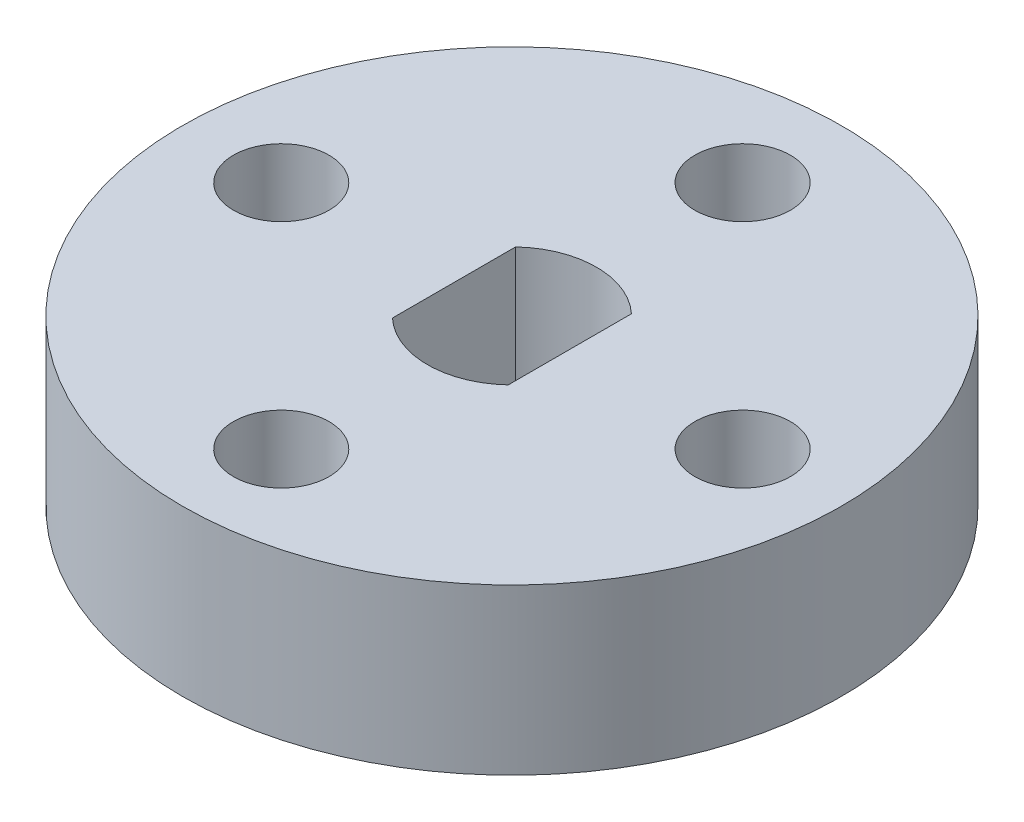
ISO-10303-21;
HEADER;
FILE_DESCRIPTION(('STEP AP214'),'2;1');
FILE_NAME('part.step','',(''),(''),'','','');
FILE_SCHEMA(('AUTOMOTIVE_DESIGN { 1 0 10303 214 1 1 1 1 }'));
ENDSEC;
DATA;
#1=APPLICATION_CONTEXT('core data for automotive mechanical design processes');
#2=APPLICATION_PROTOCOL_DEFINITION('international standard','automotive_design',2000,#1);
#3=PRODUCT_CONTEXT('',#1,'mechanical');
#4=PRODUCT('Part','Part','',(#3));
#5=PRODUCT_RELATED_PRODUCT_CATEGORY('part','',(#4));
#6=PRODUCT_DEFINITION_FORMATION('','',#4);
#7=PRODUCT_DEFINITION_CONTEXT('part definition',#1,'design');
#8=PRODUCT_DEFINITION('design','',#6,#7);
#9=PRODUCT_DEFINITION_SHAPE('','',#8);
#10=(LENGTH_UNIT() NAMED_UNIT(*) SI_UNIT(.MILLI.,.METRE.));
#11=(NAMED_UNIT(*) PLANE_ANGLE_UNIT() SI_UNIT($,.RADIAN.));
#12=(NAMED_UNIT(*) SI_UNIT($,.STERADIAN.) SOLID_ANGLE_UNIT());
#13=UNCERTAINTY_MEASURE_WITH_UNIT(LENGTH_MEASURE(1.E-05),#10,'distance_accuracy_value','');
#14=(GEOMETRIC_REPRESENTATION_CONTEXT(3) GLOBAL_UNCERTAINTY_ASSIGNED_CONTEXT((#13)) GLOBAL_UNIT_ASSIGNED_CONTEXT((#10,
#11,#12)) REPRESENTATION_CONTEXT('',''));
#15=CARTESIAN_POINT('',(0.,0.,0.));
#16=DIRECTION('',(0.,0.,1.));
#17=DIRECTION('',(1.,0.,0.));
#18=AXIS2_PLACEMENT_3D('',#15,#16,#17);
#19=CARTESIAN_POINT('',(0.,2.5,0.));
#20=DIRECTION('',(0.,1.,0.));
#21=DIRECTION('',(0.,0.,1.));
#22=AXIS2_PLACEMENT_3D('',#19,#20,#21);
#23=PLANE('',#22);
#24=CARTESIAN_POINT('',(-6.9999999999999,2.5,0.));
#25=DIRECTION('',(0.,1.,0.));
#26=DIRECTION('',(0.,0.,1.));
#27=AXIS2_PLACEMENT_3D('',#24,#25,#26);
#28=CIRCLE('',#27,1.44999999999995);
#29=CARTESIAN_POINT('',(-6.9999999999999,2.5,1.44999999999995));
#30=VERTEX_POINT('',#29);
#31=EDGE_CURVE('E208',#30,#30,#28,.T.);
#32=ORIENTED_EDGE('',*,*,#31,.F.);
#33=EDGE_LOOP('',(#32));
#34=FACE_BOUND('',#33,.T.);
#35=CARTESIAN_POINT('',(7.00000000000012,2.5,0.));
#36=DIRECTION('',(0.,1.,0.));
#37=DIRECTION('',(0.,0.,1.));
#38=AXIS2_PLACEMENT_3D('',#35,#36,#37);
#39=CIRCLE('',#38,1.44999999999995);
#40=CARTESIAN_POINT('',(7.00000000000012,2.5,1.44999999999995));
#41=VERTEX_POINT('',#40);
#42=EDGE_CURVE('E103',#41,#41,#39,.T.);
#43=ORIENTED_EDGE('',*,*,#42,.F.);
#44=EDGE_LOOP('',(#43));
#45=FACE_BOUND('',#44,.T.);
#46=CARTESIAN_POINT('',(0.,2.5,0.));
#47=DIRECTION('',(0.,1.,0.));
#48=DIRECTION('',(0.,0.,1.));
#49=AXIS2_PLACEMENT_3D('',#46,#47,#48);
#50=CIRCLE('',#49,10.);
#51=CARTESIAN_POINT('',(0.,2.5,10.));
#52=VERTEX_POINT('',#51);
#53=EDGE_CURVE('E11',#52,#52,#50,.T.);
#54=ORIENTED_EDGE('',*,*,#53,.T.);
#55=EDGE_LOOP('',(#54));
#56=FACE_BOUND('',#55,.T.);
#57=DIRECTION('',(0.,0.,1.));
#58=VECTOR('',#57,1.);
#59=CARTESIAN_POINT('',(-1.75749999999986,2.5,0.));
#60=LINE('',#59,#58);
#61=CARTESIAN_POINT('',(-1.75749999999986,2.5,-1.86826624173309));
#62=VERTEX_POINT('',#61);
#63=CARTESIAN_POINT('',(-1.75749999999991,2.5,1.86826624173314));
#64=VERTEX_POINT('',#63);
#65=EDGE_CURVE('E83',#62,#64,#60,.T.);
#66=ORIENTED_EDGE('',*,*,#65,.F.);
#67=CARTESIAN_POINT('',(0.,2.5,0.));
#68=DIRECTION('',(0.,1.,0.));
#69=DIRECTION('',(0.,0.,1.));
#70=AXIS2_PLACEMENT_3D('',#67,#68,#69);
#71=CIRCLE('',#70,2.56499999999987);
#72=CARTESIAN_POINT('',(1.75750000000008,2.5,-1.86826624173309));
#73=VERTEX_POINT('',#72);
#74=EDGE_CURVE('E75',#73,#62,#71,.T.);
#75=ORIENTED_EDGE('',*,*,#74,.F.);
#76=DIRECTION('',(0.,0.,-1.));
#77=VECTOR('',#76,1.);
#78=CARTESIAN_POINT('',(1.75750000000008,2.5,0.));
#79=LINE('',#78,#77);
#80=CARTESIAN_POINT('',(1.75750000000008,2.5,1.86826624173309));
#81=VERTEX_POINT('',#80);
#82=EDGE_CURVE('E97',#81,#73,#79,.T.);
#83=ORIENTED_EDGE('',*,*,#82,.F.);
#84=CARTESIAN_POINT('',(0.,2.5,0.));
#85=DIRECTION('',(0.,1.,0.));
#86=DIRECTION('',(0.,0.,1.));
#87=AXIS2_PLACEMENT_3D('',#84,#85,#86);
#88=CIRCLE('',#87,2.56499999999987);
#89=EDGE_CURVE('E95',#64,#81,#88,.T.);
#90=ORIENTED_EDGE('',*,*,#89,.F.);
#91=EDGE_LOOP('',(#66,#75,#83,#90));
#92=FACE_BOUND('',#91,.T.);
#93=CARTESIAN_POINT('',(0.,2.5,-7.00000000000012));
#94=DIRECTION('',(0.,1.,0.));
#95=DIRECTION('',(0.,0.,1.));
#96=AXIS2_PLACEMENT_3D('',#93,#94,#95);
#97=CIRCLE('',#96,1.44999999999995);
#98=CARTESIAN_POINT('',(0.,2.5,-5.55000000000017));
#99=VERTEX_POINT('',#98);
#100=EDGE_CURVE('E214',#99,#99,#97,.T.);
#101=ORIENTED_EDGE('',*,*,#100,.F.);
#102=EDGE_LOOP('',(#101));
#103=FACE_BOUND('',#102,.T.);
#104=CARTESIAN_POINT('',(-8.88178419700125E-13,2.5,7.00000000000012));
#105=DIRECTION('',(0.,1.,0.));
#106=DIRECTION('',(0.,0.,1.));
#107=AXIS2_PLACEMENT_3D('',#104,#105,#106);
#108=CIRCLE('',#107,1.44999999999995);
#109=CARTESIAN_POINT('',(-8.88178419700125E-13,2.5,8.45000000000007));
#110=VERTEX_POINT('',#109);
#111=EDGE_CURVE('E199',#110,#110,#108,.T.);
#112=ORIENTED_EDGE('',*,*,#111,.F.);
#113=EDGE_LOOP('',(#112));
#114=FACE_BOUND('',#113,.T.);
#115=ADVANCED_FACE('F34',(#34,#45,#56,#92,#103,#114),#23,.T.);
#116=CARTESIAN_POINT('',(0.,-2.5,0.));
#117=DIRECTION('',(0.,1.,0.));
#118=DIRECTION('',(0.,0.,1.));
#119=AXIS2_PLACEMENT_3D('',#116,#117,#118);
#120=PLANE('',#119);
#121=CARTESIAN_POINT('',(0.,-2.5,0.));
#122=DIRECTION('',(0.,1.,0.));
#123=DIRECTION('',(0.,0.,1.));
#124=AXIS2_PLACEMENT_3D('',#121,#122,#123);
#125=CIRCLE('',#124,10.);
#126=CARTESIAN_POINT('',(0.,-2.5,10.));
#127=VERTEX_POINT('',#126);
#128=EDGE_CURVE('E38',#127,#127,#125,.T.);
#129=ORIENTED_EDGE('',*,*,#128,.F.);
#130=EDGE_LOOP('',(#129));
#131=FACE_BOUND('',#130,.T.);
#132=CARTESIAN_POINT('',(0.,-2.5,0.));
#133=DIRECTION('',(0.,1.,0.));
#134=DIRECTION('',(0.,0.,1.));
#135=AXIS2_PLACEMENT_3D('',#132,#133,#134);
#136=CIRCLE('',#135,2.56499999999987);
#137=CARTESIAN_POINT('',(1.75750000000008,-2.5,-1.86826624173309));
#138=VERTEX_POINT('',#137);
#139=CARTESIAN_POINT('',(-1.75749999999986,-2.5,-1.86826624173309));
#140=VERTEX_POINT('',#139);
#141=EDGE_CURVE('E57',#138,#140,#136,.T.);
#142=ORIENTED_EDGE('',*,*,#141,.T.);
#143=DIRECTION('',(0.,0.,1.));
#144=VECTOR('',#143,1.);
#145=CARTESIAN_POINT('',(-1.75749999999986,-2.5,0.));
#146=LINE('',#145,#144);
#147=CARTESIAN_POINT('',(-1.75749999999991,-2.5,1.86826624173314));
#148=VERTEX_POINT('',#147);
#149=EDGE_CURVE('E90',#140,#148,#146,.T.);
#150=ORIENTED_EDGE('',*,*,#149,.T.);
#151=CARTESIAN_POINT('',(0.,-2.5,0.));
#152=DIRECTION('',(0.,1.,0.));
#153=DIRECTION('',(0.,0.,1.));
#154=AXIS2_PLACEMENT_3D('',#151,#152,#153);
#155=CIRCLE('',#154,2.56499999999987);
#156=CARTESIAN_POINT('',(1.75750000000008,-2.5,1.86826624173309));
#157=VERTEX_POINT('',#156);
#158=EDGE_CURVE('E105',#148,#157,#155,.T.);
#159=ORIENTED_EDGE('',*,*,#158,.T.);
#160=DIRECTION('',(0.,0.,-1.));
#161=VECTOR('',#160,1.);
#162=CARTESIAN_POINT('',(1.75750000000008,-2.5,0.));
#163=LINE('',#162,#161);
#164=EDGE_CURVE('E84',#157,#138,#163,.T.);
#165=ORIENTED_EDGE('',*,*,#164,.T.);
#166=EDGE_LOOP('',(#142,#150,#159,#165));
#167=FACE_BOUND('',#166,.T.);
#168=CARTESIAN_POINT('',(7.00000000000012,-2.5,0.));
#169=DIRECTION('',(0.,1.,0.));
#170=DIRECTION('',(0.,0.,1.));
#171=AXIS2_PLACEMENT_3D('',#168,#169,#170);
#172=CIRCLE('',#171,1.44999999999995);
#173=CARTESIAN_POINT('',(7.00000000000012,-2.5,1.44999999999995));
#174=VERTEX_POINT('',#173);
#175=EDGE_CURVE('E217',#174,#174,#172,.T.);
#176=ORIENTED_EDGE('',*,*,#175,.T.);
#177=EDGE_LOOP('',(#176));
#178=FACE_BOUND('',#177,.T.);
#179=CARTESIAN_POINT('',(0.,-2.5,-7.00000000000012));
#180=DIRECTION('',(0.,1.,0.));
#181=DIRECTION('',(0.,0.,1.));
#182=AXIS2_PLACEMENT_3D('',#179,#180,#181);
#183=CIRCLE('',#182,1.44999999999995);
#184=CARTESIAN_POINT('',(0.,-2.5,-5.55000000000017));
#185=VERTEX_POINT('',#184);
#186=EDGE_CURVE('E211',#185,#185,#183,.T.);
#187=ORIENTED_EDGE('',*,*,#186,.T.);
#188=EDGE_LOOP('',(#187));
#189=FACE_BOUND('',#188,.T.);
#190=CARTESIAN_POINT('',(-6.9999999999999,-2.5,0.));
#191=DIRECTION('',(0.,1.,0.));
#192=DIRECTION('',(0.,0.,1.));
#193=AXIS2_PLACEMENT_3D('',#190,#191,#192);
#194=CIRCLE('',#193,1.44999999999995);
#195=CARTESIAN_POINT('',(-6.9999999999999,-2.5,1.44999999999995));
#196=VERTEX_POINT('',#195);
#197=EDGE_CURVE('E205',#196,#196,#194,.T.);
#198=ORIENTED_EDGE('',*,*,#197,.T.);
#199=EDGE_LOOP('',(#198));
#200=FACE_BOUND('',#199,.T.);
#201=CARTESIAN_POINT('',(-8.88178419700125E-13,-2.5,7.00000000000012));
#202=DIRECTION('',(0.,1.,0.));
#203=DIRECTION('',(0.,0.,1.));
#204=AXIS2_PLACEMENT_3D('',#201,#202,#203);
#205=CIRCLE('',#204,1.44999999999995);
#206=CARTESIAN_POINT('',(-8.88178419700125E-13,-2.5,8.45000000000007));
#207=VERTEX_POINT('',#206);
#208=EDGE_CURVE('E202',#207,#207,#205,.T.);
#209=ORIENTED_EDGE('',*,*,#208,.T.);
#210=EDGE_LOOP('',(#209));
#211=FACE_BOUND('',#210,.T.);
#212=ADVANCED_FACE('F116',(#131,#167,#178,#189,#200,#211),#120,.F.);
#213=CARTESIAN_POINT('',(0.,2.5,0.));
#214=DIRECTION('',(0.,-1.,0.));
#215=DIRECTION('',(0.,0.,-1.));
#216=AXIS2_PLACEMENT_3D('',#213,#214,#215);
#217=CYLINDRICAL_SURFACE('',#216,10.);
#218=ORIENTED_EDGE('',*,*,#53,.F.);
#219=EDGE_LOOP('',(#218));
#220=FACE_BOUND('',#219,.T.);
#221=ORIENTED_EDGE('',*,*,#128,.T.);
#222=EDGE_LOOP('',(#221));
#223=FACE_BOUND('',#222,.T.);
#224=ADVANCED_FACE('F36',(#220,#223),#217,.T.);
#225=CARTESIAN_POINT('',(0.,2.5,0.));
#226=DIRECTION('',(0.,-1.,0.));
#227=DIRECTION('',(0.,0.,-1.));
#228=AXIS2_PLACEMENT_3D('',#225,#226,#227);
#229=CYLINDRICAL_SURFACE('',#228,2.56499999999987);
#230=ORIENTED_EDGE('',*,*,#141,.F.);
#231=DIRECTION('',(0.,-1.,0.));
#232=VECTOR('',#231,1.);
#233=CARTESIAN_POINT('',(1.75750000000008,2.5,-1.86826624173309));
#234=LINE('',#233,#232);
#235=EDGE_CURVE('E79',#73,#138,#234,.T.);
#236=ORIENTED_EDGE('',*,*,#235,.F.);
#237=ORIENTED_EDGE('',*,*,#74,.T.);
#238=DIRECTION('',(0.,-1.,0.));
#239=VECTOR('',#238,1.);
#240=CARTESIAN_POINT('',(-1.75749999999986,2.5,-1.86826624173309));
#241=LINE('',#240,#239);
#242=EDGE_CURVE('E78',#62,#140,#241,.T.);
#243=ORIENTED_EDGE('',*,*,#242,.T.);
#244=EDGE_LOOP('',(#230,#236,#237,#243));
#245=FACE_BOUND('',#244,.T.);
#246=ADVANCED_FACE('F77',(#245),#229,.F.);
#247=CARTESIAN_POINT('',(-1.75749999999986,2.5,0.));
#248=DIRECTION('',(1.,0.,0.));
#249=DIRECTION('',(0.,0.,-1.));
#250=AXIS2_PLACEMENT_3D('',#247,#248,#249);
#251=PLANE('',#250);
#252=ORIENTED_EDGE('',*,*,#149,.F.);
#253=ORIENTED_EDGE('',*,*,#242,.F.);
#254=ORIENTED_EDGE('',*,*,#65,.T.);
#255=DIRECTION('',(0.,-1.,0.));
#256=VECTOR('',#255,1.);
#257=CARTESIAN_POINT('',(-1.75749999999991,2.5,1.86826624173314));
#258=LINE('',#257,#256);
#259=EDGE_CURVE('E91',#64,#148,#258,.T.);
#260=ORIENTED_EDGE('',*,*,#259,.T.);
#261=EDGE_LOOP('',(#252,#253,#254,#260));
#262=FACE_BOUND('',#261,.T.);
#263=ADVANCED_FACE('F87',(#262),#251,.T.);
#264=CARTESIAN_POINT('',(0.,2.5,0.));
#265=DIRECTION('',(0.,-1.,0.));
#266=DIRECTION('',(0.,0.,-1.));
#267=AXIS2_PLACEMENT_3D('',#264,#265,#266);
#268=CYLINDRICAL_SURFACE('',#267,2.56499999999987);
#269=ORIENTED_EDGE('',*,*,#158,.F.);
#270=ORIENTED_EDGE('',*,*,#259,.F.);
#271=ORIENTED_EDGE('',*,*,#89,.T.);
#272=DIRECTION('',(0.,-1.,0.));
#273=VECTOR('',#272,1.);
#274=CARTESIAN_POINT('',(1.75750000000008,2.5,1.86826624173309));
#275=LINE('',#274,#273);
#276=EDGE_CURVE('E49',#81,#157,#275,.T.);
#277=ORIENTED_EDGE('',*,*,#276,.T.);
#278=EDGE_LOOP('',(#269,#270,#271,#277));
#279=FACE_BOUND('',#278,.T.);
#280=ADVANCED_FACE('F114',(#279),#268,.F.);
#281=CARTESIAN_POINT('',(1.75750000000008,2.5,0.));
#282=DIRECTION('',(-1.,0.,0.));
#283=DIRECTION('',(0.,0.,1.));
#284=AXIS2_PLACEMENT_3D('',#281,#282,#283);
#285=PLANE('',#284);
#286=ORIENTED_EDGE('',*,*,#164,.F.);
#287=ORIENTED_EDGE('',*,*,#276,.F.);
#288=ORIENTED_EDGE('',*,*,#82,.T.);
#289=ORIENTED_EDGE('',*,*,#235,.T.);
#290=EDGE_LOOP('',(#286,#287,#288,#289));
#291=FACE_BOUND('',#290,.T.);
#292=ADVANCED_FACE('F118',(#291),#285,.T.);
#293=CARTESIAN_POINT('',(7.00000000000012,2.5,0.));
#294=DIRECTION('',(0.,-1.,0.));
#295=DIRECTION('',(0.,0.,-1.));
#296=AXIS2_PLACEMENT_3D('',#293,#294,#295);
#297=CYLINDRICAL_SURFACE('',#296,1.44999999999995);
#298=ORIENTED_EDGE('',*,*,#42,.T.);
#299=EDGE_LOOP('',(#298));
#300=FACE_BOUND('',#299,.T.);
#301=ORIENTED_EDGE('',*,*,#175,.F.);
#302=EDGE_LOOP('',(#301));
#303=FACE_BOUND('',#302,.T.);
#304=ADVANCED_FACE('F120',(#300,#303),#297,.F.);
#305=CARTESIAN_POINT('',(0.,2.5,-7.00000000000012));
#306=DIRECTION('',(0.,-1.,0.));
#307=DIRECTION('',(0.,0.,-1.));
#308=AXIS2_PLACEMENT_3D('',#305,#306,#307);
#309=CYLINDRICAL_SURFACE('',#308,1.44999999999995);
#310=ORIENTED_EDGE('',*,*,#100,.T.);
#311=EDGE_LOOP('',(#310));
#312=FACE_BOUND('',#311,.T.);
#313=ORIENTED_EDGE('',*,*,#186,.F.);
#314=EDGE_LOOP('',(#313));
#315=FACE_BOUND('',#314,.T.);
#316=ADVANCED_FACE('F126',(#312,#315),#309,.F.);
#317=CARTESIAN_POINT('',(-6.9999999999999,2.5,0.));
#318=DIRECTION('',(0.,-1.,0.));
#319=DIRECTION('',(0.,0.,-1.));
#320=AXIS2_PLACEMENT_3D('',#317,#318,#319);
#321=CYLINDRICAL_SURFACE('',#320,1.44999999999995);
#322=ORIENTED_EDGE('',*,*,#31,.T.);
#323=EDGE_LOOP('',(#322));
#324=FACE_BOUND('',#323,.T.);
#325=ORIENTED_EDGE('',*,*,#197,.F.);
#326=EDGE_LOOP('',(#325));
#327=FACE_BOUND('',#326,.T.);
#328=ADVANCED_FACE('F172',(#324,#327),#321,.F.);
#329=CARTESIAN_POINT('',(-8.88178419700125E-13,2.5,7.00000000000012));
#330=DIRECTION('',(0.,-1.,0.));
#331=DIRECTION('',(0.,0.,-1.));
#332=AXIS2_PLACEMENT_3D('',#329,#330,#331);
#333=CYLINDRICAL_SURFACE('',#332,1.44999999999995);
#334=ORIENTED_EDGE('',*,*,#111,.T.);
#335=EDGE_LOOP('',(#334));
#336=FACE_BOUND('',#335,.T.);
#337=ORIENTED_EDGE('',*,*,#208,.F.);
#338=EDGE_LOOP('',(#337));
#339=FACE_BOUND('',#338,.T.);
#340=ADVANCED_FACE('F182',(#336,#339),#333,.F.);
#341=CLOSED_SHELL('',(#115,#212,#224,#246,#263,#280,#292,#304,#316,#328,#340));
#342=MANIFOLD_SOLID_BREP('B2',#341);
#343=ADVANCED_BREP_SHAPE_REPRESENTATION('',(#18,#342),#14);
#344=SHAPE_DEFINITION_REPRESENTATION(#9,#343);
ENDSEC;
END-ISO-10303-21;
